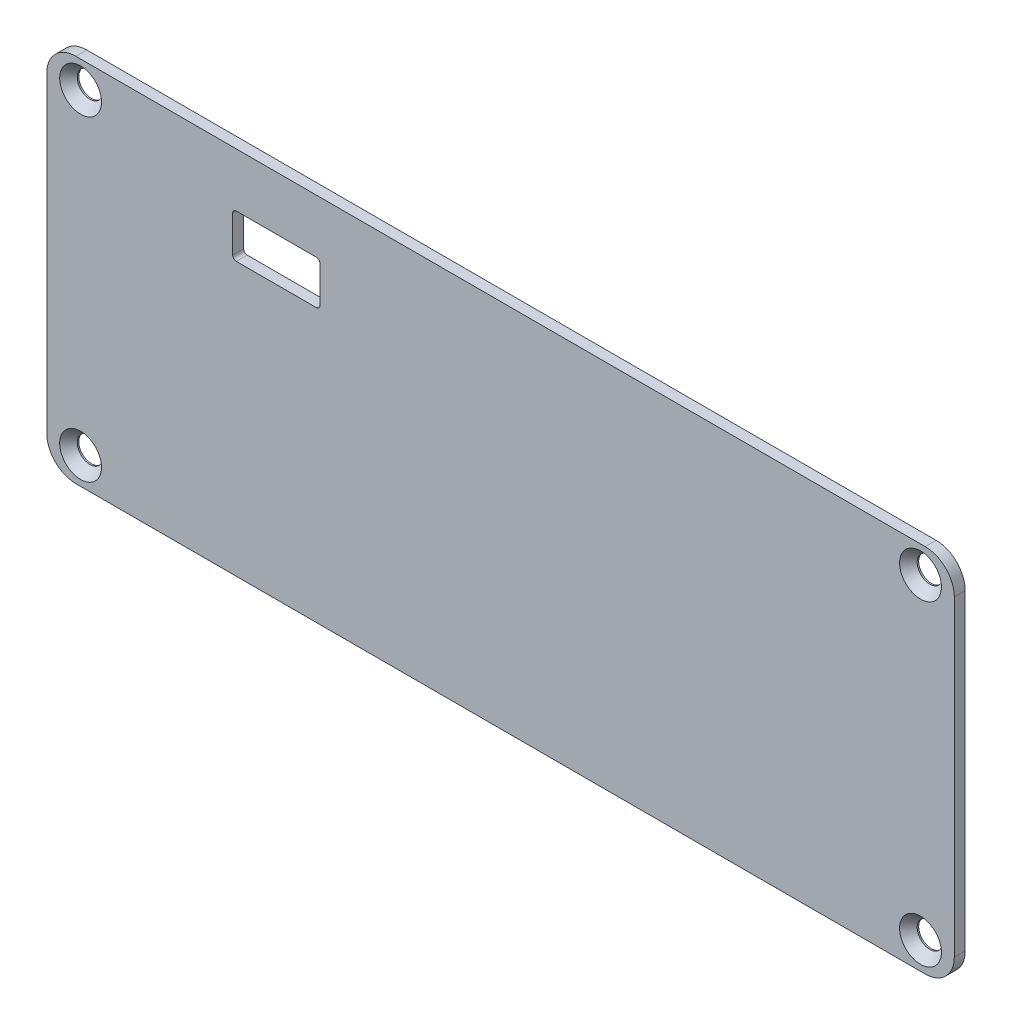
ISO-10303-21;
HEADER;
FILE_DESCRIPTION(('STEP AP214'),'2;1');
FILE_NAME('part.step','',(''),(''),'','','');
FILE_SCHEMA(('AUTOMOTIVE_DESIGN { 1 0 10303 214 1 1 1 1 }'));
ENDSEC;
DATA;
#1=APPLICATION_CONTEXT('core data for automotive mechanical design processes');
#2=APPLICATION_PROTOCOL_DEFINITION('international standard','automotive_design',2000,#1);
#3=PRODUCT_CONTEXT('',#1,'mechanical');
#4=PRODUCT('Part','Part','',(#3));
#5=PRODUCT_RELATED_PRODUCT_CATEGORY('part','',(#4));
#6=PRODUCT_DEFINITION_FORMATION('','',#4);
#7=PRODUCT_DEFINITION_CONTEXT('part definition',#1,'design');
#8=PRODUCT_DEFINITION('design','',#6,#7);
#9=PRODUCT_DEFINITION_SHAPE('','',#8);
#10=(LENGTH_UNIT() NAMED_UNIT(*) SI_UNIT(.MILLI.,.METRE.));
#11=(NAMED_UNIT(*) PLANE_ANGLE_UNIT() SI_UNIT($,.RADIAN.));
#12=(NAMED_UNIT(*) SI_UNIT($,.STERADIAN.) SOLID_ANGLE_UNIT());
#13=UNCERTAINTY_MEASURE_WITH_UNIT(LENGTH_MEASURE(1.E-05),#10,'distance_accuracy_value','');
#14=(GEOMETRIC_REPRESENTATION_CONTEXT(3) GLOBAL_UNCERTAINTY_ASSIGNED_CONTEXT((#13)) GLOBAL_UNIT_ASSIGNED_CONTEXT((#10,
#11,#12)) REPRESENTATION_CONTEXT('',''));
#15=CARTESIAN_POINT('',(0.,0.,0.));
#16=DIRECTION('',(0.,0.,1.));
#17=DIRECTION('',(1.,0.,0.));
#18=AXIS2_PLACEMENT_3D('',#15,#16,#17);
#19=CARTESIAN_POINT('',(0.,-7.4,1.5));
#20=DIRECTION('',(0.,1.,0.));
#21=DIRECTION('',(0.,0.,1.));
#22=AXIS2_PLACEMENT_3D('',#19,#20,#21);
#23=PLANE('',#22);
#24=DIRECTION('',(1.,0.,0.));
#25=VECTOR('',#24,1.);
#26=CARTESIAN_POINT('',(0.,-7.4,0.));
#27=LINE('',#26,#25);
#28=CARTESIAN_POINT('',(26.065,-7.4,0.));
#29=VERTEX_POINT('',#28);
#30=CARTESIAN_POINT('',(37.065,-7.4,0.));
#31=VERTEX_POINT('',#30);
#32=EDGE_CURVE('E179',#29,#31,#27,.T.);
#33=ORIENTED_EDGE('',*,*,#32,.T.);
#34=DIRECTION('',(0.,0.,-1.));
#35=VECTOR('',#34,1.);
#36=CARTESIAN_POINT('',(37.065,-7.4,1.5));
#37=LINE('',#36,#35);
#38=CARTESIAN_POINT('',(37.065,-7.4,1.5));
#39=VERTEX_POINT('',#38);
#40=EDGE_CURVE('E50',#31,#39,#37,.F.);
#41=ORIENTED_EDGE('',*,*,#40,.T.);
#42=DIRECTION('',(1.,0.,0.));
#43=VECTOR('',#42,1.);
#44=CARTESIAN_POINT('',(0.,-7.4,1.5));
#45=LINE('',#44,#43);
#46=CARTESIAN_POINT('',(26.065,-7.4,1.5));
#47=VERTEX_POINT('',#46);
#48=EDGE_CURVE('E262',#47,#39,#45,.T.);
#49=ORIENTED_EDGE('',*,*,#48,.F.);
#50=DIRECTION('',(0.,0.,-1.));
#51=VECTOR('',#50,1.);
#52=CARTESIAN_POINT('',(26.065,-7.4,1.5));
#53=LINE('',#52,#51);
#54=EDGE_CURVE('E238',#47,#29,#53,.T.);
#55=ORIENTED_EDGE('',*,*,#54,.T.);
#56=EDGE_LOOP('',(#33,#41,#49,#55));
#57=FACE_BOUND('',#56,.T.);
#58=ADVANCED_FACE('F35',(#57),#23,.F.);
#59=CARTESIAN_POINT('',(37.565,0.,1.5));
#60=DIRECTION('',(1.,0.,0.));
#61=DIRECTION('',(0.,0.,-1.));
#62=AXIS2_PLACEMENT_3D('',#59,#60,#61);
#63=PLANE('',#62);
#64=DIRECTION('',(0.,-1.,0.));
#65=VECTOR('',#64,1.);
#66=CARTESIAN_POINT('',(37.565,0.,0.));
#67=LINE('',#66,#65);
#68=CARTESIAN_POINT('',(37.565,-7.9,0.));
#69=VERTEX_POINT('',#68);
#70=CARTESIAN_POINT('',(37.565,-12.9,0.));
#71=VERTEX_POINT('',#70);
#72=EDGE_CURVE('E186',#69,#71,#67,.T.);
#73=ORIENTED_EDGE('',*,*,#72,.T.);
#74=DIRECTION('',(0.,0.,-1.));
#75=VECTOR('',#74,1.);
#76=CARTESIAN_POINT('',(37.565,-12.9,1.5));
#77=LINE('',#76,#75);
#78=CARTESIAN_POINT('',(37.565,-12.9,1.5));
#79=VERTEX_POINT('',#78);
#80=EDGE_CURVE('E236',#71,#79,#77,.F.);
#81=ORIENTED_EDGE('',*,*,#80,.T.);
#82=DIRECTION('',(0.,-1.,0.));
#83=VECTOR('',#82,1.);
#84=CARTESIAN_POINT('',(37.565,0.,1.5));
#85=LINE('',#84,#83);
#86=CARTESIAN_POINT('',(37.565,-7.9,1.5));
#87=VERTEX_POINT('',#86);
#88=EDGE_CURVE('E264',#87,#79,#85,.T.);
#89=ORIENTED_EDGE('',*,*,#88,.F.);
#90=DIRECTION('',(0.,0.,-1.));
#91=VECTOR('',#90,1.);
#92=CARTESIAN_POINT('',(37.565,-7.9,0.));
#93=LINE('',#92,#91);
#94=EDGE_CURVE('E233',#87,#69,#93,.T.);
#95=ORIENTED_EDGE('',*,*,#94,.T.);
#96=EDGE_LOOP('',(#73,#81,#89,#95));
#97=FACE_BOUND('',#96,.T.);
#98=ADVANCED_FACE('F328',(#97),#63,.F.);
#99=CARTESIAN_POINT('',(0.,-13.4,1.5));
#100=DIRECTION('',(0.,1.,0.));
#101=DIRECTION('',(-1.,0.,0.));
#102=AXIS2_PLACEMENT_3D('',#99,#100,#101);
#103=PLANE('',#102);
#104=DIRECTION('',(1.,0.,0.));
#105=VECTOR('',#104,1.);
#106=CARTESIAN_POINT('',(0.,-13.4,0.));
#107=LINE('',#106,#105);
#108=CARTESIAN_POINT('',(26.065,-13.4,0.));
#109=VERTEX_POINT('',#108);
#110=CARTESIAN_POINT('',(37.065,-13.4,0.));
#111=VERTEX_POINT('',#110);
#112=EDGE_CURVE('E189',#109,#111,#107,.T.);
#113=ORIENTED_EDGE('',*,*,#112,.F.);
#114=DIRECTION('',(0.,0.,-1.));
#115=VECTOR('',#114,1.);
#116=CARTESIAN_POINT('',(26.065,-13.4,1.5));
#117=LINE('',#116,#115);
#118=CARTESIAN_POINT('',(26.065,-13.4,1.5));
#119=VERTEX_POINT('',#118);
#120=EDGE_CURVE('E231',#109,#119,#117,.F.);
#121=ORIENTED_EDGE('',*,*,#120,.T.);
#122=DIRECTION('',(1.,0.,0.));
#123=VECTOR('',#122,1.);
#124=CARTESIAN_POINT('',(0.,-13.4,1.5));
#125=LINE('',#124,#123);
#126=CARTESIAN_POINT('',(37.065,-13.4,1.5));
#127=VERTEX_POINT('',#126);
#128=EDGE_CURVE('E268',#119,#127,#125,.T.);
#129=ORIENTED_EDGE('',*,*,#128,.T.);
#130=DIRECTION('',(0.,0.,-1.));
#131=VECTOR('',#130,1.);
#132=CARTESIAN_POINT('',(37.065,-13.4,1.5));
#133=LINE('',#132,#131);
#134=EDGE_CURVE('E228',#127,#111,#133,.T.);
#135=ORIENTED_EDGE('',*,*,#134,.T.);
#136=EDGE_LOOP('',(#113,#121,#129,#135));
#137=FACE_BOUND('',#136,.T.);
#138=ADVANCED_FACE('F325',(#137),#103,.T.);
#139=CARTESIAN_POINT('',(124.8,0.,1.5));
#140=DIRECTION('',(1.,0.,0.));
#141=DIRECTION('',(0.,0.,-1.));
#142=AXIS2_PLACEMENT_3D('',#139,#140,#141);
#143=PLANE('',#142);
#144=DIRECTION('',(0.,-1.,0.));
#145=VECTOR('',#144,1.);
#146=CARTESIAN_POINT('',(124.8,0.,0.));
#147=LINE('',#146,#145);
#148=CARTESIAN_POINT('',(124.8,-4.,0.));
#149=VERTEX_POINT('',#148);
#150=CARTESIAN_POINT('',(124.8,-46.9,0.));
#151=VERTEX_POINT('',#150);
#152=EDGE_CURVE('E181',#149,#151,#147,.T.);
#153=ORIENTED_EDGE('',*,*,#152,.F.);
#154=DIRECTION('',(0.,0.,-1.));
#155=VECTOR('',#154,1.);
#156=CARTESIAN_POINT('',(124.8,-4.,1.5));
#157=LINE('',#156,#155);
#158=CARTESIAN_POINT('',(124.8,-4.,1.5));
#159=VERTEX_POINT('',#158);
#160=EDGE_CURVE('E216',#149,#159,#157,.F.);
#161=ORIENTED_EDGE('',*,*,#160,.T.);
#162=DIRECTION('',(0.,-1.,0.));
#163=VECTOR('',#162,1.);
#164=CARTESIAN_POINT('',(124.8,0.,1.5));
#165=LINE('',#164,#163);
#166=CARTESIAN_POINT('',(124.8,-46.9,1.5));
#167=VERTEX_POINT('',#166);
#168=EDGE_CURVE('E195',#159,#167,#165,.T.);
#169=ORIENTED_EDGE('',*,*,#168,.T.);
#170=DIRECTION('',(0.,0.,-1.));
#171=VECTOR('',#170,1.);
#172=CARTESIAN_POINT('',(124.8,-46.9,0.));
#173=LINE('',#172,#171);
#174=EDGE_CURVE('E213',#167,#151,#173,.T.);
#175=ORIENTED_EDGE('',*,*,#174,.T.);
#176=EDGE_LOOP('',(#153,#161,#169,#175));
#177=FACE_BOUND('',#176,.T.);
#178=ADVANCED_FACE('F309',(#177),#143,.T.);
#179=CARTESIAN_POINT('',(0.,0.,1.5));
#180=DIRECTION('',(0.,1.,0.));
#181=DIRECTION('',(0.,0.,1.));
#182=AXIS2_PLACEMENT_3D('',#179,#180,#181);
#183=PLANE('',#182);
#184=DIRECTION('',(1.,0.,0.));
#185=VECTOR('',#184,1.);
#186=CARTESIAN_POINT('',(0.,0.,0.));
#187=LINE('',#186,#185);
#188=CARTESIAN_POINT('',(4.,0.,0.));
#189=VERTEX_POINT('',#188);
#190=CARTESIAN_POINT('',(120.8,0.,0.));
#191=VERTEX_POINT('',#190);
#192=EDGE_CURVE('E176',#189,#191,#187,.T.);
#193=ORIENTED_EDGE('',*,*,#192,.F.);
#194=DIRECTION('',(0.,0.,-1.));
#195=VECTOR('',#194,1.);
#196=CARTESIAN_POINT('',(4.,0.,1.5));
#197=LINE('',#196,#195);
#198=CARTESIAN_POINT('',(4.,0.,1.5));
#199=VERTEX_POINT('',#198);
#200=EDGE_CURVE('E153',#189,#199,#197,.F.);
#201=ORIENTED_EDGE('',*,*,#200,.T.);
#202=DIRECTION('',(1.,0.,0.));
#203=VECTOR('',#202,1.);
#204=CARTESIAN_POINT('',(0.,0.,1.5));
#205=LINE('',#204,#203);
#206=CARTESIAN_POINT('',(120.8,0.,1.5));
#207=VERTEX_POINT('',#206);
#208=EDGE_CURVE('E291',#199,#207,#205,.T.);
#209=ORIENTED_EDGE('',*,*,#208,.T.);
#210=DIRECTION('',(0.,0.,-1.));
#211=VECTOR('',#210,1.);
#212=CARTESIAN_POINT('',(120.8,0.,1.5));
#213=LINE('',#212,#211);
#214=EDGE_CURVE('E158',#207,#191,#213,.T.);
#215=ORIENTED_EDGE('',*,*,#214,.T.);
#216=EDGE_LOOP('',(#193,#201,#209,#215));
#217=FACE_BOUND('',#216,.T.);
#218=ADVANCED_FACE('F317',(#217),#183,.T.);
#219=CARTESIAN_POINT('',(0.,0.,1.5));
#220=DIRECTION('',(1.,0.,0.));
#221=DIRECTION('',(0.,1.,0.));
#222=AXIS2_PLACEMENT_3D('',#219,#220,#221);
#223=PLANE('',#222);
#224=DIRECTION('',(0.,-1.,0.));
#225=VECTOR('',#224,1.);
#226=CARTESIAN_POINT('',(0.,0.,1.5));
#227=LINE('',#226,#225);
#228=CARTESIAN_POINT('',(0.,-4.,1.5));
#229=VERTEX_POINT('',#228);
#230=CARTESIAN_POINT('',(0.,-46.9,1.5));
#231=VERTEX_POINT('',#230);
#232=EDGE_CURVE('E168',#229,#231,#227,.T.);
#233=ORIENTED_EDGE('',*,*,#232,.F.);
#234=DIRECTION('',(0.,0.,-1.));
#235=VECTOR('',#234,1.);
#236=CARTESIAN_POINT('',(0.,-4.,0.));
#237=LINE('',#236,#235);
#238=CARTESIAN_POINT('',(0.,-4.,0.));
#239=VERTEX_POINT('',#238);
#240=EDGE_CURVE('E152',#229,#239,#237,.T.);
#241=ORIENTED_EDGE('',*,*,#240,.T.);
#242=DIRECTION('',(0.,-1.,0.));
#243=VECTOR('',#242,1.);
#244=CARTESIAN_POINT('',(0.,0.,0.));
#245=LINE('',#244,#243);
#246=CARTESIAN_POINT('',(0.,-46.9,0.));
#247=VERTEX_POINT('',#246);
#248=EDGE_CURVE('E165',#239,#247,#245,.T.);
#249=ORIENTED_EDGE('',*,*,#248,.T.);
#250=DIRECTION('',(0.,0.,-1.));
#251=VECTOR('',#250,1.);
#252=CARTESIAN_POINT('',(0.,-46.9,1.5));
#253=LINE('',#252,#251);
#254=EDGE_CURVE('E170',#247,#231,#253,.F.);
#255=ORIENTED_EDGE('',*,*,#254,.T.);
#256=EDGE_LOOP('',(#233,#241,#249,#255));
#257=FACE_BOUND('',#256,.T.);
#258=ADVANCED_FACE('F164',(#257),#223,.F.);
#259=CARTESIAN_POINT('',(0.,-50.9,1.5));
#260=DIRECTION('',(0.,1.,0.));
#261=DIRECTION('',(0.,0.,1.));
#262=AXIS2_PLACEMENT_3D('',#259,#260,#261);
#263=PLANE('',#262);
#264=DIRECTION('',(1.,0.,0.));
#265=VECTOR('',#264,1.);
#266=CARTESIAN_POINT('',(0.,-50.9,0.));
#267=LINE('',#266,#265);
#268=CARTESIAN_POINT('',(4.00000000000001,-50.9,0.));
#269=VERTEX_POINT('',#268);
#270=CARTESIAN_POINT('',(120.8,-50.9,0.));
#271=VERTEX_POINT('',#270);
#272=EDGE_CURVE('E175',#269,#271,#267,.T.);
#273=ORIENTED_EDGE('',*,*,#272,.T.);
#274=DIRECTION('',(0.,0.,-1.));
#275=VECTOR('',#274,1.);
#276=CARTESIAN_POINT('',(120.8,-50.9,1.5));
#277=LINE('',#276,#275);
#278=CARTESIAN_POINT('',(120.8,-50.9,1.5));
#279=VERTEX_POINT('',#278);
#280=EDGE_CURVE('E221',#271,#279,#277,.F.);
#281=ORIENTED_EDGE('',*,*,#280,.T.);
#282=DIRECTION('',(1.,0.,0.));
#283=VECTOR('',#282,1.);
#284=CARTESIAN_POINT('',(0.,-50.9,1.5));
#285=LINE('',#284,#283);
#286=CARTESIAN_POINT('',(4.00000000000001,-50.9,1.5));
#287=VERTEX_POINT('',#286);
#288=EDGE_CURVE('E265',#287,#279,#285,.T.);
#289=ORIENTED_EDGE('',*,*,#288,.F.);
#290=DIRECTION('',(0.,0.,-1.));
#291=VECTOR('',#290,1.);
#292=CARTESIAN_POINT('',(4.00000000000001,-50.9,1.5));
#293=LINE('',#292,#291);
#294=EDGE_CURVE('E218',#287,#269,#293,.T.);
#295=ORIENTED_EDGE('',*,*,#294,.T.);
#296=EDGE_LOOP('',(#273,#281,#289,#295));
#297=FACE_BOUND('',#296,.T.);
#298=ADVANCED_FACE('F302',(#297),#263,.F.);
#299=CARTESIAN_POINT('',(25.565,0.,1.5));
#300=DIRECTION('',(1.,0.,0.));
#301=DIRECTION('',(0.,0.,-1.));
#302=AXIS2_PLACEMENT_3D('',#299,#300,#301);
#303=PLANE('',#302);
#304=DIRECTION('',(0.,-1.,0.));
#305=VECTOR('',#304,1.);
#306=CARTESIAN_POINT('',(25.565,0.,1.5));
#307=LINE('',#306,#305);
#308=CARTESIAN_POINT('',(25.565,-7.9,1.5));
#309=VERTEX_POINT('',#308);
#310=CARTESIAN_POINT('',(25.565,-12.9,1.5));
#311=VERTEX_POINT('',#310);
#312=EDGE_CURVE('E196',#309,#311,#307,.T.);
#313=ORIENTED_EDGE('',*,*,#312,.T.);
#314=DIRECTION('',(0.,0.,-1.));
#315=VECTOR('',#314,1.);
#316=CARTESIAN_POINT('',(25.565,-12.9,0.));
#317=LINE('',#316,#315);
#318=CARTESIAN_POINT('',(25.565,-12.9,0.));
#319=VERTEX_POINT('',#318);
#320=EDGE_CURVE('E225',#311,#319,#317,.T.);
#321=ORIENTED_EDGE('',*,*,#320,.T.);
#322=DIRECTION('',(0.,-1.,0.));
#323=VECTOR('',#322,1.);
#324=CARTESIAN_POINT('',(25.565,0.,0.));
#325=LINE('',#324,#323);
#326=CARTESIAN_POINT('',(25.565,-7.9,0.));
#327=VERTEX_POINT('',#326);
#328=EDGE_CURVE('E192',#327,#319,#325,.T.);
#329=ORIENTED_EDGE('',*,*,#328,.F.);
#330=DIRECTION('',(0.,0.,-1.));
#331=VECTOR('',#330,1.);
#332=CARTESIAN_POINT('',(25.565,-7.9,1.5));
#333=LINE('',#332,#331);
#334=EDGE_CURVE('E223',#327,#309,#333,.F.);
#335=ORIENTED_EDGE('',*,*,#334,.T.);
#336=EDGE_LOOP('',(#313,#321,#329,#335));
#337=FACE_BOUND('',#336,.T.);
#338=ADVANCED_FACE('F260',(#337),#303,.T.);
#339=CARTESIAN_POINT('',(0.,0.,1.5));
#340=DIRECTION('',(0.,0.,1.));
#341=DIRECTION('',(1.,0.,0.));
#342=AXIS2_PLACEMENT_3D('',#339,#340,#341);
#343=PLANE('',#342);
#344=CARTESIAN_POINT('',(4.64999999999999,-3.7,1.5));
#345=DIRECTION('',(0.,0.,1.));
#346=DIRECTION('',(1.,0.,0.));
#347=AXIS2_PLACEMENT_3D('',#344,#345,#346);
#348=CIRCLE('',#347,2.875);
#349=CARTESIAN_POINT('',(7.52499999999999,-3.7,1.5));
#350=VERTEX_POINT('',#349);
#351=EDGE_CURVE('E457',#350,#350,#348,.T.);
#352=ORIENTED_EDGE('',*,*,#351,.F.);
#353=EDGE_LOOP('',(#352));
#354=FACE_BOUND('',#353,.T.);
#355=CARTESIAN_POINT('',(120.15,-3.7,1.5));
#356=DIRECTION('',(0.,0.,1.));
#357=DIRECTION('',(1.,0.,0.));
#358=AXIS2_PLACEMENT_3D('',#355,#356,#357);
#359=CIRCLE('',#358,2.875);
#360=CARTESIAN_POINT('',(123.025,-3.7,1.5));
#361=VERTEX_POINT('',#360);
#362=EDGE_CURVE('E448',#361,#361,#359,.T.);
#363=ORIENTED_EDGE('',*,*,#362,.F.);
#364=EDGE_LOOP('',(#363));
#365=FACE_BOUND('',#364,.T.);
#366=CARTESIAN_POINT('',(120.15,-47.2,1.5));
#367=DIRECTION('',(0.,0.,1.));
#368=DIRECTION('',(1.,0.,0.));
#369=AXIS2_PLACEMENT_3D('',#366,#367,#368);
#370=CIRCLE('',#369,2.875);
#371=CARTESIAN_POINT('',(123.025,-47.2,1.5));
#372=VERTEX_POINT('',#371);
#373=EDGE_CURVE('E439',#372,#372,#370,.T.);
#374=ORIENTED_EDGE('',*,*,#373,.F.);
#375=EDGE_LOOP('',(#374));
#376=FACE_BOUND('',#375,.T.);
#377=CARTESIAN_POINT('',(4.64999999999999,-47.2,1.5));
#378=DIRECTION('',(0.,0.,1.));
#379=DIRECTION('',(1.,0.,0.));
#380=AXIS2_PLACEMENT_3D('',#377,#378,#379);
#381=CIRCLE('',#380,2.875);
#382=CARTESIAN_POINT('',(7.52499999999999,-47.2,1.5));
#383=VERTEX_POINT('',#382);
#384=EDGE_CURVE('E285',#383,#383,#381,.T.);
#385=ORIENTED_EDGE('',*,*,#384,.F.);
#386=EDGE_LOOP('',(#385));
#387=FACE_BOUND('',#386,.T.);
#388=ORIENTED_EDGE('',*,*,#208,.F.);
#389=CARTESIAN_POINT('',(4.,-4.,1.5));
#390=DIRECTION('',(0.,0.,1.));
#391=DIRECTION('',(1.,0.,0.));
#392=AXIS2_PLACEMENT_3D('',#389,#390,#391);
#393=CIRCLE('',#392,4.);
#394=EDGE_CURVE('E211',#199,#229,#393,.T.);
#395=ORIENTED_EDGE('',*,*,#394,.T.);
#396=ORIENTED_EDGE('',*,*,#232,.T.);
#397=CARTESIAN_POINT('',(4.00000000000001,-46.9,1.5));
#398=DIRECTION('',(0.,0.,1.));
#399=DIRECTION('',(1.,0.,0.));
#400=AXIS2_PLACEMENT_3D('',#397,#398,#399);
#401=CIRCLE('',#400,4.);
#402=EDGE_CURVE('E205',#231,#287,#401,.T.);
#403=ORIENTED_EDGE('',*,*,#402,.T.);
#404=ORIENTED_EDGE('',*,*,#288,.T.);
#405=CARTESIAN_POINT('',(120.8,-46.9,1.5));
#406=DIRECTION('',(0.,0.,1.));
#407=DIRECTION('',(1.,0.,0.));
#408=AXIS2_PLACEMENT_3D('',#405,#406,#407);
#409=CIRCLE('',#408,4.);
#410=EDGE_CURVE('E207',#279,#167,#409,.T.);
#411=ORIENTED_EDGE('',*,*,#410,.T.);
#412=ORIENTED_EDGE('',*,*,#168,.F.);
#413=CARTESIAN_POINT('',(120.8,-4.,1.5));
#414=DIRECTION('',(0.,0.,1.));
#415=DIRECTION('',(1.,0.,0.));
#416=AXIS2_PLACEMENT_3D('',#413,#414,#415);
#417=CIRCLE('',#416,4.);
#418=EDGE_CURVE('E209',#159,#207,#417,.T.);
#419=ORIENTED_EDGE('',*,*,#418,.T.);
#420=EDGE_LOOP('',(#388,#395,#396,#403,#404,#411,#412,#419));
#421=FACE_BOUND('',#420,.T.);
#422=ORIENTED_EDGE('',*,*,#312,.F.);
#423=CARTESIAN_POINT('',(26.065,-7.9,1.5));
#424=DIRECTION('',(0.,0.,1.));
#425=DIRECTION('',(1.,0.,0.));
#426=AXIS2_PLACEMENT_3D('',#423,#424,#425);
#427=CIRCLE('',#426,0.5);
#428=EDGE_CURVE('E11',#309,#47,#427,.F.);
#429=ORIENTED_EDGE('',*,*,#428,.T.);
#430=ORIENTED_EDGE('',*,*,#48,.T.);
#431=CARTESIAN_POINT('',(37.065,-7.9,1.5));
#432=DIRECTION('',(0.,0.,1.));
#433=DIRECTION('',(1.,0.,0.));
#434=AXIS2_PLACEMENT_3D('',#431,#432,#433);
#435=CIRCLE('',#434,0.5);
#436=EDGE_CURVE('E252',#39,#87,#435,.F.);
#437=ORIENTED_EDGE('',*,*,#436,.T.);
#438=ORIENTED_EDGE('',*,*,#88,.T.);
#439=CARTESIAN_POINT('',(37.065,-12.9,1.5));
#440=DIRECTION('',(0.,0.,1.));
#441=DIRECTION('',(1.,0.,0.));
#442=AXIS2_PLACEMENT_3D('',#439,#440,#441);
#443=CIRCLE('',#442,0.5);
#444=EDGE_CURVE('E248',#79,#127,#443,.F.);
#445=ORIENTED_EDGE('',*,*,#444,.T.);
#446=ORIENTED_EDGE('',*,*,#128,.F.);
#447=CARTESIAN_POINT('',(26.065,-12.9,1.5));
#448=DIRECTION('',(0.,0.,1.));
#449=DIRECTION('',(1.,0.,0.));
#450=AXIS2_PLACEMENT_3D('',#447,#448,#449);
#451=CIRCLE('',#450,0.5);
#452=EDGE_CURVE('E244',#119,#311,#451,.F.);
#453=ORIENTED_EDGE('',*,*,#452,.T.);
#454=EDGE_LOOP('',(#422,#429,#430,#437,#438,#445,#446,#453));
#455=FACE_BOUND('',#454,.T.);
#456=ADVANCED_FACE('F296',(#354,#365,#376,#387,#421,#455),#343,.T.);
#457=CARTESIAN_POINT('',(0.,0.,0.));
#458=DIRECTION('',(0.,0.,1.));
#459=DIRECTION('',(1.,0.,0.));
#460=AXIS2_PLACEMENT_3D('',#457,#458,#459);
#461=PLANE('',#460);
#462=CARTESIAN_POINT('',(4.64999999999999,-3.7,0.));
#463=DIRECTION('',(0.,0.,1.));
#464=DIRECTION('',(1.,0.,0.));
#465=AXIS2_PLACEMENT_3D('',#462,#463,#464);
#466=CIRCLE('',#465,1.75);
#467=CARTESIAN_POINT('',(6.39999999999999,-3.7,0.));
#468=VERTEX_POINT('',#467);
#469=EDGE_CURVE('E451',#468,#468,#466,.T.);
#470=ORIENTED_EDGE('',*,*,#469,.T.);
#471=EDGE_LOOP('',(#470));
#472=FACE_BOUND('',#471,.T.);
#473=CARTESIAN_POINT('',(120.15,-3.7,0.));
#474=DIRECTION('',(0.,0.,1.));
#475=DIRECTION('',(1.,0.,0.));
#476=AXIS2_PLACEMENT_3D('',#473,#474,#475);
#477=CIRCLE('',#476,1.75);
#478=CARTESIAN_POINT('',(121.9,-3.7,0.));
#479=VERTEX_POINT('',#478);
#480=EDGE_CURVE('E442',#479,#479,#477,.T.);
#481=ORIENTED_EDGE('',*,*,#480,.T.);
#482=EDGE_LOOP('',(#481));
#483=FACE_BOUND('',#482,.T.);
#484=CARTESIAN_POINT('',(120.15,-47.2,0.));
#485=DIRECTION('',(0.,0.,1.));
#486=DIRECTION('',(1.,0.,0.));
#487=AXIS2_PLACEMENT_3D('',#484,#485,#486);
#488=CIRCLE('',#487,1.75);
#489=CARTESIAN_POINT('',(121.9,-47.2,0.));
#490=VERTEX_POINT('',#489);
#491=EDGE_CURVE('E432',#490,#490,#488,.T.);
#492=ORIENTED_EDGE('',*,*,#491,.T.);
#493=EDGE_LOOP('',(#492));
#494=FACE_BOUND('',#493,.T.);
#495=CARTESIAN_POINT('',(4.64999999999999,-47.2,0.));
#496=DIRECTION('',(0.,0.,1.));
#497=DIRECTION('',(1.,0.,0.));
#498=AXIS2_PLACEMENT_3D('',#495,#496,#497);
#499=CIRCLE('',#498,1.75);
#500=CARTESIAN_POINT('',(6.39999999999999,-47.2,0.));
#501=VERTEX_POINT('',#500);
#502=EDGE_CURVE('E277',#501,#501,#499,.T.);
#503=ORIENTED_EDGE('',*,*,#502,.T.);
#504=EDGE_LOOP('',(#503));
#505=FACE_BOUND('',#504,.T.);
#506=ORIENTED_EDGE('',*,*,#248,.F.);
#507=CARTESIAN_POINT('',(4.,-4.,0.));
#508=DIRECTION('',(0.,0.,1.));
#509=DIRECTION('',(1.,0.,0.));
#510=AXIS2_PLACEMENT_3D('',#507,#508,#509);
#511=CIRCLE('',#510,4.);
#512=EDGE_CURVE('E148',#239,#189,#511,.F.);
#513=ORIENTED_EDGE('',*,*,#512,.T.);
#514=ORIENTED_EDGE('',*,*,#192,.T.);
#515=CARTESIAN_POINT('',(120.8,-4.,0.));
#516=DIRECTION('',(0.,0.,1.));
#517=DIRECTION('',(1.,0.,0.));
#518=AXIS2_PLACEMENT_3D('',#515,#516,#517);
#519=CIRCLE('',#518,4.);
#520=EDGE_CURVE('E159',#191,#149,#519,.F.);
#521=ORIENTED_EDGE('',*,*,#520,.T.);
#522=ORIENTED_EDGE('',*,*,#152,.T.);
#523=CARTESIAN_POINT('',(120.8,-46.9,0.));
#524=DIRECTION('',(0.,0.,1.));
#525=DIRECTION('',(1.,0.,0.));
#526=AXIS2_PLACEMENT_3D('',#523,#524,#525);
#527=CIRCLE('',#526,4.);
#528=EDGE_CURVE('E199',#151,#271,#527,.F.);
#529=ORIENTED_EDGE('',*,*,#528,.T.);
#530=ORIENTED_EDGE('',*,*,#272,.F.);
#531=CARTESIAN_POINT('',(4.00000000000001,-46.9,0.));
#532=DIRECTION('',(0.,0.,1.));
#533=DIRECTION('',(1.,0.,0.));
#534=AXIS2_PLACEMENT_3D('',#531,#532,#533);
#535=CIRCLE('',#534,4.);
#536=EDGE_CURVE('E169',#269,#247,#535,.F.);
#537=ORIENTED_EDGE('',*,*,#536,.T.);
#538=EDGE_LOOP('',(#506,#513,#514,#521,#522,#529,#530,#537));
#539=FACE_BOUND('',#538,.T.);
#540=ORIENTED_EDGE('',*,*,#32,.F.);
#541=CARTESIAN_POINT('',(26.065,-7.9,0.));
#542=DIRECTION('',(0.,0.,1.));
#543=DIRECTION('',(1.,0.,0.));
#544=AXIS2_PLACEMENT_3D('',#541,#542,#543);
#545=CIRCLE('',#544,0.5);
#546=EDGE_CURVE('E43',#29,#327,#545,.T.);
#547=ORIENTED_EDGE('',*,*,#546,.T.);
#548=ORIENTED_EDGE('',*,*,#328,.T.);
#549=CARTESIAN_POINT('',(26.065,-12.9,0.));
#550=DIRECTION('',(0.,0.,1.));
#551=DIRECTION('',(1.,0.,0.));
#552=AXIS2_PLACEMENT_3D('',#549,#550,#551);
#553=CIRCLE('',#552,0.5);
#554=EDGE_CURVE('E242',#319,#109,#553,.T.);
#555=ORIENTED_EDGE('',*,*,#554,.T.);
#556=ORIENTED_EDGE('',*,*,#112,.T.);
#557=CARTESIAN_POINT('',(37.065,-12.9,0.));
#558=DIRECTION('',(0.,0.,1.));
#559=DIRECTION('',(1.,0.,0.));
#560=AXIS2_PLACEMENT_3D('',#557,#558,#559);
#561=CIRCLE('',#560,0.5);
#562=EDGE_CURVE('E246',#111,#71,#561,.T.);
#563=ORIENTED_EDGE('',*,*,#562,.T.);
#564=ORIENTED_EDGE('',*,*,#72,.F.);
#565=CARTESIAN_POINT('',(37.065,-7.9,0.));
#566=DIRECTION('',(0.,0.,1.));
#567=DIRECTION('',(1.,0.,0.));
#568=AXIS2_PLACEMENT_3D('',#565,#566,#567);
#569=CIRCLE('',#568,0.5);
#570=EDGE_CURVE('E250',#69,#31,#569,.T.);
#571=ORIENTED_EDGE('',*,*,#570,.T.);
#572=EDGE_LOOP('',(#540,#547,#548,#555,#556,#563,#564,#571));
#573=FACE_BOUND('',#572,.T.);
#574=ADVANCED_FACE('F172',(#472,#483,#494,#505,#539,#573),#461,.F.);
#575=CARTESIAN_POINT('',(4.64999999999999,-47.2,1.5));
#576=DIRECTION('',(0.,0.,1.));
#577=DIRECTION('',(1.,0.,0.));
#578=AXIS2_PLACEMENT_3D('',#575,#576,#577);
#579=CYLINDRICAL_SURFACE('',#578,1.75);
#580=ORIENTED_EDGE('',*,*,#502,.F.);
#581=EDGE_LOOP('',(#580));
#582=FACE_BOUND('',#581,.T.);
#583=CARTESIAN_POINT('',(4.64999999999999,-47.2,0.205835541876365));
#584=DIRECTION('',(0.,0.,1.));
#585=DIRECTION('',(1.,0.,0.));
#586=AXIS2_PLACEMENT_3D('',#583,#584,#585);
#587=CIRCLE('',#586,1.75);
#588=CARTESIAN_POINT('',(6.39999999999999,-47.2,0.205835541876365));
#589=VERTEX_POINT('',#588);
#590=EDGE_CURVE('E280',#589,#589,#587,.T.);
#591=ORIENTED_EDGE('',*,*,#590,.T.);
#592=EDGE_LOOP('',(#591));
#593=FACE_BOUND('',#592,.T.);
#594=ADVANCED_FACE('F418',(#582,#593),#579,.F.);
#595=CARTESIAN_POINT('',(4.64999999999999,-47.2,1.5));
#596=DIRECTION('',(0.,0.,1.));
#597=DIRECTION('',(1.,0.,0.));
#598=AXIS2_PLACEMENT_3D('',#595,#596,#597);
#599=CONICAL_SURFACE('',#598,2.875,0.715584993317675);
#600=ORIENTED_EDGE('',*,*,#590,.F.);
#601=EDGE_LOOP('',(#600));
#602=FACE_BOUND('',#601,.T.);
#603=ORIENTED_EDGE('',*,*,#384,.T.);
#604=EDGE_LOOP('',(#603));
#605=FACE_BOUND('',#604,.T.);
#606=ADVANCED_FACE('F414',(#602,#605),#599,.F.);
#607=CARTESIAN_POINT('',(120.15,-47.2,1.5));
#608=DIRECTION('',(0.,0.,1.));
#609=DIRECTION('',(1.,0.,0.));
#610=AXIS2_PLACEMENT_3D('',#607,#608,#609);
#611=CYLINDRICAL_SURFACE('',#610,1.75);
#612=ORIENTED_EDGE('',*,*,#491,.F.);
#613=EDGE_LOOP('',(#612));
#614=FACE_BOUND('',#613,.T.);
#615=CARTESIAN_POINT('',(120.15,-47.2,0.205835541876365));
#616=DIRECTION('',(0.,0.,1.));
#617=DIRECTION('',(1.,0.,0.));
#618=AXIS2_PLACEMENT_3D('',#615,#616,#617);
#619=CIRCLE('',#618,1.75);
#620=CARTESIAN_POINT('',(121.9,-47.2,0.205835541876365));
#621=VERTEX_POINT('',#620);
#622=EDGE_CURVE('E434',#621,#621,#619,.T.);
#623=ORIENTED_EDGE('',*,*,#622,.T.);
#624=EDGE_LOOP('',(#623));
#625=FACE_BOUND('',#624,.T.);
#626=ADVANCED_FACE('F410',(#614,#625),#611,.F.);
#627=CARTESIAN_POINT('',(120.15,-47.2,1.5));
#628=DIRECTION('',(0.,0.,1.));
#629=DIRECTION('',(1.,0.,0.));
#630=AXIS2_PLACEMENT_3D('',#627,#628,#629);
#631=CONICAL_SURFACE('',#630,2.875,0.715584993317676);
#632=ORIENTED_EDGE('',*,*,#622,.F.);
#633=EDGE_LOOP('',(#632));
#634=FACE_BOUND('',#633,.T.);
#635=ORIENTED_EDGE('',*,*,#373,.T.);
#636=EDGE_LOOP('',(#635));
#637=FACE_BOUND('',#636,.T.);
#638=ADVANCED_FACE('F406',(#634,#637),#631,.F.);
#639=CARTESIAN_POINT('',(120.15,-3.7,1.5));
#640=DIRECTION('',(0.,0.,1.));
#641=DIRECTION('',(1.,0.,0.));
#642=AXIS2_PLACEMENT_3D('',#639,#640,#641);
#643=CYLINDRICAL_SURFACE('',#642,1.75);
#644=ORIENTED_EDGE('',*,*,#480,.F.);
#645=EDGE_LOOP('',(#644));
#646=FACE_BOUND('',#645,.T.);
#647=CARTESIAN_POINT('',(120.15,-3.7,0.205835541876365));
#648=DIRECTION('',(0.,0.,1.));
#649=DIRECTION('',(1.,0.,0.));
#650=AXIS2_PLACEMENT_3D('',#647,#648,#649);
#651=CIRCLE('',#650,1.75);
#652=CARTESIAN_POINT('',(121.9,-3.7,0.205835541876365));
#653=VERTEX_POINT('',#652);
#654=EDGE_CURVE('E445',#653,#653,#651,.T.);
#655=ORIENTED_EDGE('',*,*,#654,.T.);
#656=EDGE_LOOP('',(#655));
#657=FACE_BOUND('',#656,.T.);
#658=ADVANCED_FACE('F402',(#646,#657),#643,.F.);
#659=CARTESIAN_POINT('',(120.15,-3.7,1.5));
#660=DIRECTION('',(0.,0.,1.));
#661=DIRECTION('',(1.,0.,0.));
#662=AXIS2_PLACEMENT_3D('',#659,#660,#661);
#663=CONICAL_SURFACE('',#662,2.875,0.715584993317676);
#664=ORIENTED_EDGE('',*,*,#654,.F.);
#665=EDGE_LOOP('',(#664));
#666=FACE_BOUND('',#665,.T.);
#667=ORIENTED_EDGE('',*,*,#362,.T.);
#668=EDGE_LOOP('',(#667));
#669=FACE_BOUND('',#668,.T.);
#670=ADVANCED_FACE('F394',(#666,#669),#663,.F.);
#671=CARTESIAN_POINT('',(4.64999999999999,-3.7,1.5));
#672=DIRECTION('',(0.,0.,1.));
#673=DIRECTION('',(1.,0.,0.));
#674=AXIS2_PLACEMENT_3D('',#671,#672,#673);
#675=CYLINDRICAL_SURFACE('',#674,1.75);
#676=ORIENTED_EDGE('',*,*,#469,.F.);
#677=EDGE_LOOP('',(#676));
#678=FACE_BOUND('',#677,.T.);
#679=CARTESIAN_POINT('',(4.64999999999999,-3.7,0.205835541876365));
#680=DIRECTION('',(0.,0.,1.));
#681=DIRECTION('',(1.,0.,0.));
#682=AXIS2_PLACEMENT_3D('',#679,#680,#681);
#683=CIRCLE('',#682,1.75);
#684=CARTESIAN_POINT('',(6.39999999999999,-3.7,0.205835541876365));
#685=VERTEX_POINT('',#684);
#686=EDGE_CURVE('E454',#685,#685,#683,.T.);
#687=ORIENTED_EDGE('',*,*,#686,.T.);
#688=EDGE_LOOP('',(#687));
#689=FACE_BOUND('',#688,.T.);
#690=ADVANCED_FACE('F388',(#678,#689),#675,.F.);
#691=CARTESIAN_POINT('',(4.64999999999999,-3.7,1.5));
#692=DIRECTION('',(0.,0.,1.));
#693=DIRECTION('',(1.,0.,0.));
#694=AXIS2_PLACEMENT_3D('',#691,#692,#693);
#695=CONICAL_SURFACE('',#694,2.875,0.715584993317675);
#696=ORIENTED_EDGE('',*,*,#686,.F.);
#697=EDGE_LOOP('',(#696));
#698=FACE_BOUND('',#697,.T.);
#699=ORIENTED_EDGE('',*,*,#351,.T.);
#700=EDGE_LOOP('',(#699));
#701=FACE_BOUND('',#700,.T.);
#702=ADVANCED_FACE('F384',(#698,#701),#695,.F.);
#703=CARTESIAN_POINT('',(4.,-4.,1.5));
#704=DIRECTION('',(0.,0.,1.));
#705=DIRECTION('',(1.,0.,0.));
#706=AXIS2_PLACEMENT_3D('',#703,#704,#705);
#707=CYLINDRICAL_SURFACE('',#706,4.);
#708=ORIENTED_EDGE('',*,*,#394,.F.);
#709=ORIENTED_EDGE('',*,*,#200,.F.);
#710=ORIENTED_EDGE('',*,*,#512,.F.);
#711=ORIENTED_EDGE('',*,*,#240,.F.);
#712=EDGE_LOOP('',(#708,#709,#710,#711));
#713=FACE_BOUND('',#712,.T.);
#714=ADVANCED_FACE('F151',(#713),#707,.T.);
#715=CARTESIAN_POINT('',(120.8,-4.,1.5));
#716=DIRECTION('',(0.,0.,-1.));
#717=DIRECTION('',(-1.,0.,0.));
#718=AXIS2_PLACEMENT_3D('',#715,#716,#717);
#719=CYLINDRICAL_SURFACE('',#718,4.);
#720=ORIENTED_EDGE('',*,*,#418,.F.);
#721=ORIENTED_EDGE('',*,*,#160,.F.);
#722=ORIENTED_EDGE('',*,*,#520,.F.);
#723=ORIENTED_EDGE('',*,*,#214,.F.);
#724=EDGE_LOOP('',(#720,#721,#722,#723));
#725=FACE_BOUND('',#724,.T.);
#726=ADVANCED_FACE('F315',(#725),#719,.T.);
#727=CARTESIAN_POINT('',(120.8,-46.9,1.5));
#728=DIRECTION('',(0.,0.,1.));
#729=DIRECTION('',(1.,0.,0.));
#730=AXIS2_PLACEMENT_3D('',#727,#728,#729);
#731=CYLINDRICAL_SURFACE('',#730,4.);
#732=ORIENTED_EDGE('',*,*,#410,.F.);
#733=ORIENTED_EDGE('',*,*,#280,.F.);
#734=ORIENTED_EDGE('',*,*,#528,.F.);
#735=ORIENTED_EDGE('',*,*,#174,.F.);
#736=EDGE_LOOP('',(#732,#733,#734,#735));
#737=FACE_BOUND('',#736,.T.);
#738=ADVANCED_FACE('F307',(#737),#731,.T.);
#739=CARTESIAN_POINT('',(4.00000000000001,-46.9,1.5));
#740=DIRECTION('',(0.,0.,-1.));
#741=DIRECTION('',(-1.,0.,0.));
#742=AXIS2_PLACEMENT_3D('',#739,#740,#741);
#743=CYLINDRICAL_SURFACE('',#742,4.);
#744=ORIENTED_EDGE('',*,*,#402,.F.);
#745=ORIENTED_EDGE('',*,*,#254,.F.);
#746=ORIENTED_EDGE('',*,*,#536,.F.);
#747=ORIENTED_EDGE('',*,*,#294,.F.);
#748=EDGE_LOOP('',(#744,#745,#746,#747));
#749=FACE_BOUND('',#748,.T.);
#750=ADVANCED_FACE('F300',(#749),#743,.T.);
#751=CARTESIAN_POINT('',(26.065,-12.9,1.5));
#752=DIRECTION('',(0.,0.,1.));
#753=DIRECTION('',(1.,0.,0.));
#754=AXIS2_PLACEMENT_3D('',#751,#752,#753);
#755=CYLINDRICAL_SURFACE('',#754,0.5);
#756=ORIENTED_EDGE('',*,*,#452,.F.);
#757=ORIENTED_EDGE('',*,*,#120,.F.);
#758=ORIENTED_EDGE('',*,*,#554,.F.);
#759=ORIENTED_EDGE('',*,*,#320,.F.);
#760=EDGE_LOOP('',(#756,#757,#758,#759));
#761=FACE_BOUND('',#760,.T.);
#762=ADVANCED_FACE('F358',(#761),#755,.F.);
#763=CARTESIAN_POINT('',(37.065,-12.9,1.5));
#764=DIRECTION('',(0.,0.,-1.));
#765=DIRECTION('',(-1.,0.,0.));
#766=AXIS2_PLACEMENT_3D('',#763,#764,#765);
#767=CYLINDRICAL_SURFACE('',#766,0.5);
#768=ORIENTED_EDGE('',*,*,#444,.F.);
#769=ORIENTED_EDGE('',*,*,#80,.F.);
#770=ORIENTED_EDGE('',*,*,#562,.F.);
#771=ORIENTED_EDGE('',*,*,#134,.F.);
#772=EDGE_LOOP('',(#768,#769,#770,#771));
#773=FACE_BOUND('',#772,.T.);
#774=ADVANCED_FACE('F361',(#773),#767,.F.);
#775=CARTESIAN_POINT('',(37.065,-7.9,1.5));
#776=DIRECTION('',(0.,0.,1.));
#777=DIRECTION('',(1.,0.,0.));
#778=AXIS2_PLACEMENT_3D('',#775,#776,#777);
#779=CYLINDRICAL_SURFACE('',#778,0.5);
#780=ORIENTED_EDGE('',*,*,#436,.F.);
#781=ORIENTED_EDGE('',*,*,#40,.F.);
#782=ORIENTED_EDGE('',*,*,#570,.F.);
#783=ORIENTED_EDGE('',*,*,#94,.F.);
#784=EDGE_LOOP('',(#780,#781,#782,#783));
#785=FACE_BOUND('',#784,.T.);
#786=ADVANCED_FACE('F367',(#785),#779,.F.);
#787=CARTESIAN_POINT('',(26.065,-7.9,1.5));
#788=DIRECTION('',(0.,0.,-1.));
#789=DIRECTION('',(-1.,0.,0.));
#790=AXIS2_PLACEMENT_3D('',#787,#788,#789);
#791=CYLINDRICAL_SURFACE('',#790,0.5);
#792=ORIENTED_EDGE('',*,*,#428,.F.);
#793=ORIENTED_EDGE('',*,*,#334,.F.);
#794=ORIENTED_EDGE('',*,*,#546,.F.);
#795=ORIENTED_EDGE('',*,*,#54,.F.);
#796=EDGE_LOOP('',(#792,#793,#794,#795));
#797=FACE_BOUND('',#796,.T.);
#798=ADVANCED_FACE('F37',(#797),#791,.F.);
#799=CLOSED_SHELL('',(#58,#98,#138,#178,#218,#258,#298,#338,#456,#574,#594,#606,#626,#638,#658,
#670,#690,#702,#714,#726,#738,#750,#762,#774,#786,#798));
#800=MANIFOLD_SOLID_BREP('B2',#799);
#801=ADVANCED_BREP_SHAPE_REPRESENTATION('',(#18,#800),#14);
#802=SHAPE_DEFINITION_REPRESENTATION(#9,#801);
ENDSEC;
END-ISO-10303-21;
